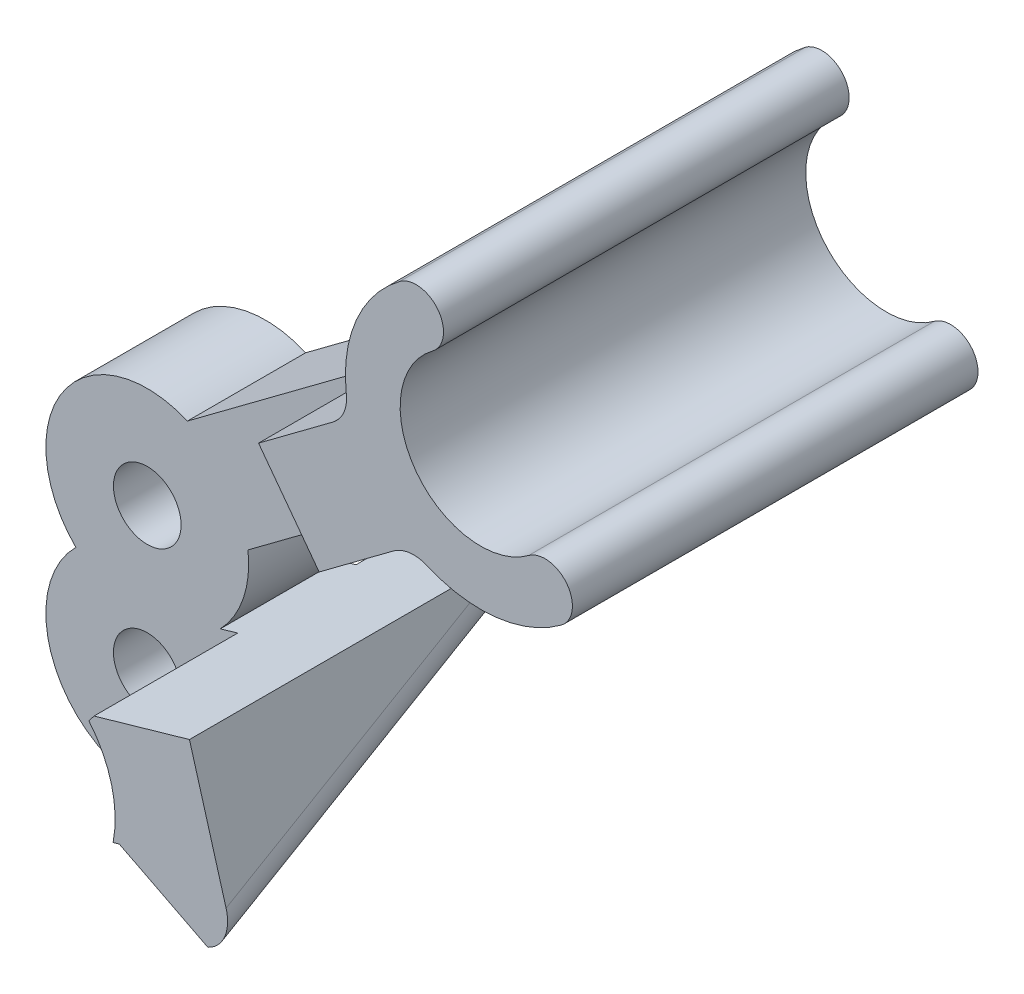
ISO-10303-21;
HEADER;
FILE_DESCRIPTION(('STEP AP214'),'2;1');
FILE_NAME('part.step','',(''),(''),'','','');
FILE_SCHEMA(('AUTOMOTIVE_DESIGN { 1 0 10303 214 1 1 1 1 }'));
ENDSEC;
DATA;
#1=APPLICATION_CONTEXT('core data for automotive mechanical design processes');
#2=APPLICATION_PROTOCOL_DEFINITION('international standard','automotive_design',2000,#1);
#3=PRODUCT_CONTEXT('',#1,'mechanical');
#4=PRODUCT('Part','Part','',(#3));
#5=PRODUCT_RELATED_PRODUCT_CATEGORY('part','',(#4));
#6=PRODUCT_DEFINITION_FORMATION('','',#4);
#7=PRODUCT_DEFINITION_CONTEXT('part definition',#1,'design');
#8=PRODUCT_DEFINITION('design','',#6,#7);
#9=PRODUCT_DEFINITION_SHAPE('','',#8);
#10=(LENGTH_UNIT() NAMED_UNIT(*) SI_UNIT(.MILLI.,.METRE.));
#11=(NAMED_UNIT(*) PLANE_ANGLE_UNIT() SI_UNIT($,.RADIAN.));
#12=(NAMED_UNIT(*) SI_UNIT($,.STERADIAN.) SOLID_ANGLE_UNIT());
#13=UNCERTAINTY_MEASURE_WITH_UNIT(LENGTH_MEASURE(1.E-05),#10,'distance_accuracy_value','');
#14=(GEOMETRIC_REPRESENTATION_CONTEXT(3) GLOBAL_UNCERTAINTY_ASSIGNED_CONTEXT((#13)) GLOBAL_UNIT_ASSIGNED_CONTEXT((#10,
#11,#12)) REPRESENTATION_CONTEXT('',''));
#15=CARTESIAN_POINT('',(0.,0.,0.));
#16=DIRECTION('',(0.,0.,1.));
#17=DIRECTION('',(1.,0.,0.));
#18=AXIS2_PLACEMENT_3D('',#15,#16,#17);
#19=CARTESIAN_POINT('',(12.034625399238,11.3594857649784,12.));
#20=DIRECTION('',(-0.597625146975519,0.801775644243755,0.));
#21=DIRECTION('',(-0.801775644243755,-0.59762514697552,0.));
#22=AXIS2_PLACEMENT_3D('',#19,#20,#21);
#23=PLANE('',#22);
#24=DIRECTION('',(0.801775644243755,0.59762514697552,0.));
#25=VECTOR('',#24,1.);
#26=CARTESIAN_POINT('',(12.034625399238,11.3594857649784,0.));
#27=LINE('',#26,#25);
#28=CARTESIAN_POINT('',(9.33520353574942,9.34739871856042,0.));
#29=VERTEX_POINT('',#28);
#30=CARTESIAN_POINT('',(11.5358986788997,10.9877463242975,0.));
#31=VERTEX_POINT('',#30);
#32=EDGE_CURVE('E301',#29,#31,#27,.T.);
#33=ORIENTED_EDGE('',*,*,#32,.T.);
#34=DIRECTION('',(0.,0.,1.));
#35=VECTOR('',#34,1.);
#36=CARTESIAN_POINT('',(11.5358986788997,10.9877463242975,12.));
#37=LINE('',#36,#35);
#38=CARTESIAN_POINT('',(11.5358986788997,10.9877463242975,12.));
#39=VERTEX_POINT('',#38);
#40=EDGE_CURVE('E249',#31,#39,#37,.T.);
#41=ORIENTED_EDGE('',*,*,#40,.T.);
#42=DIRECTION('',(0.801775644243755,0.59762514697552,0.));
#43=VECTOR('',#42,1.);
#44=CARTESIAN_POINT('',(12.034625399238,11.3594857649784,12.));
#45=LINE('',#44,#43);
#46=CARTESIAN_POINT('',(9.33520353574942,9.34739871856042,12.));
#47=VERTEX_POINT('',#46);
#48=EDGE_CURVE('E389',#47,#39,#45,.T.);
#49=ORIENTED_EDGE('',*,*,#48,.F.);
#50=DIRECTION('',(0.,0.,1.));
#51=VECTOR('',#50,1.);
#52=CARTESIAN_POINT('',(9.33520353574942,9.34739871856042,-3.68469303146442));
#53=LINE('',#52,#51);
#54=CARTESIAN_POINT('',(9.33520353574942,9.34739871856042,7.75));
#55=VERTEX_POINT('',#54);
#56=EDGE_CURVE('E421',#55,#47,#53,.T.);
#57=ORIENTED_EDGE('',*,*,#56,.F.);
#58=DIRECTION('',(0.801775644243755,0.59762514697552,0.));
#59=VECTOR('',#58,1.);
#60=CARTESIAN_POINT('',(12.034625399238,11.3594857649784,7.75));
#61=LINE('',#60,#59);
#62=CARTESIAN_POINT('',(2.97951194861546,4.61001221129799,7.75));
#63=VERTEX_POINT('',#62);
#64=EDGE_CURVE('E380',#63,#55,#61,.T.);
#65=ORIENTED_EDGE('',*,*,#64,.F.);
#66=DIRECTION('',(0.,0.,-1.));
#67=VECTOR('',#66,1.);
#68=CARTESIAN_POINT('',(2.97951194861546,4.61001221129799,12.));
#69=LINE('',#68,#67);
#70=CARTESIAN_POINT('',(2.97951194861546,4.61001221129799,4.25));
#71=VERTEX_POINT('',#70);
#72=EDGE_CURVE('E344',#63,#71,#69,.T.);
#73=ORIENTED_EDGE('',*,*,#72,.T.);
#74=DIRECTION('',(-0.801775644243755,-0.59762514697552,0.));
#75=VECTOR('',#74,1.);
#76=CARTESIAN_POINT('',(12.034625399238,11.3594857649784,4.25));
#77=LINE('',#76,#75);
#78=CARTESIAN_POINT('',(9.33520353574942,9.34739871856042,4.25));
#79=VERTEX_POINT('',#78);
#80=EDGE_CURVE('E556',#79,#71,#77,.T.);
#81=ORIENTED_EDGE('',*,*,#80,.F.);
#82=DIRECTION('',(0.,0.,-1.));
#83=VECTOR('',#82,1.);
#84=CARTESIAN_POINT('',(9.33520353574942,9.34739871856042,19.1846930314644));
#85=LINE('',#84,#83);
#86=EDGE_CURVE('E538',#79,#29,#85,.T.);
#87=ORIENTED_EDGE('',*,*,#86,.T.);
#88=EDGE_LOOP('',(#33,#41,#49,#57,#65,#73,#81,#87));
#89=FACE_BOUND('',#88,.T.);
#90=ADVANCED_FACE('F37',(#89),#23,.F.);
#91=CARTESIAN_POINT('',(1.18663650768889,7.01533914402926,12.));
#92=DIRECTION('',(0.597625146975519,-0.801775644243755,0.));
#93=DIRECTION('',(0.801775644243755,0.59762514697552,0.));
#94=AXIS2_PLACEMENT_3D('',#91,#92,#93);
#95=PLANE('',#94);
#96=DIRECTION('',(-0.801775644243755,-0.597625146975519,0.));
#97=VECTOR('',#96,1.);
#98=CARTESIAN_POINT('',(1.18663650768889,7.01533914402926,12.));
#99=LINE('',#98,#97);
#100=CARTESIAN_POINT('',(9.74302323797318,13.3930732570287,12.));
#101=VERTEX_POINT('',#100);
#102=CARTESIAN_POINT('',(7.54232809482285,11.7527256512917,12.));
#103=VERTEX_POINT('',#102);
#104=EDGE_CURVE('E403',#101,#103,#99,.T.);
#105=ORIENTED_EDGE('',*,*,#104,.F.);
#106=DIRECTION('',(0.,0.,1.));
#107=VECTOR('',#106,1.);
#108=CARTESIAN_POINT('',(9.74302323797318,13.3930732570287,0.));
#109=LINE('',#108,#107);
#110=CARTESIAN_POINT('',(9.74302323797318,13.3930732570287,0.));
#111=VERTEX_POINT('',#110);
#112=EDGE_CURVE('E257',#101,#111,#109,.F.);
#113=ORIENTED_EDGE('',*,*,#112,.T.);
#114=DIRECTION('',(-0.801775644243755,-0.597625146975519,0.));
#115=VECTOR('',#114,1.);
#116=CARTESIAN_POINT('',(1.18663650768889,7.01533914402926,0.));
#117=LINE('',#116,#115);
#118=CARTESIAN_POINT('',(7.54232809482285,11.7527256512917,0.));
#119=VERTEX_POINT('',#118);
#120=EDGE_CURVE('E322',#111,#119,#117,.T.);
#121=ORIENTED_EDGE('',*,*,#120,.T.);
#122=DIRECTION('',(0.,0.,-1.));
#123=VECTOR('',#122,1.);
#124=CARTESIAN_POINT('',(7.54232809482285,11.7527256512917,19.1846930314644));
#125=LINE('',#124,#123);
#126=CARTESIAN_POINT('',(7.54232809482285,11.7527256512917,4.25));
#127=VERTEX_POINT('',#126);
#128=EDGE_CURVE('E536',#127,#119,#125,.T.);
#129=ORIENTED_EDGE('',*,*,#128,.F.);
#130=DIRECTION('',(0.801775644243755,0.59762514697552,0.));
#131=VECTOR('',#130,1.);
#132=CARTESIAN_POINT('',(1.18663650768889,7.01533914402926,4.25));
#133=LINE('',#132,#131);
#134=CARTESIAN_POINT('',(1.18663650768889,7.01533914402926,4.25));
#135=VERTEX_POINT('',#134);
#136=EDGE_CURVE('E554',#135,#127,#133,.T.);
#137=ORIENTED_EDGE('',*,*,#136,.F.);
#138=DIRECTION('',(0.,0.,-1.));
#139=VECTOR('',#138,1.);
#140=CARTESIAN_POINT('',(1.18663650768889,7.01533914402926,12.));
#141=LINE('',#140,#139);
#142=CARTESIAN_POINT('',(1.18663650768889,7.01533914402926,7.75));
#143=VERTEX_POINT('',#142);
#144=EDGE_CURVE('E329',#143,#135,#141,.T.);
#145=ORIENTED_EDGE('',*,*,#144,.F.);
#146=DIRECTION('',(-0.801775644243755,-0.59762514697552,0.));
#147=VECTOR('',#146,1.);
#148=CARTESIAN_POINT('',(1.18663650768889,7.01533914402926,7.75));
#149=LINE('',#148,#147);
#150=CARTESIAN_POINT('',(7.54232809482285,11.7527256512917,7.75));
#151=VERTEX_POINT('',#150);
#152=EDGE_CURVE('E378',#151,#143,#149,.T.);
#153=ORIENTED_EDGE('',*,*,#152,.F.);
#154=DIRECTION('',(0.,0.,1.));
#155=VECTOR('',#154,1.);
#156=CARTESIAN_POINT('',(7.54232809482285,11.7527256512917,-3.68469303146442));
#157=LINE('',#156,#155);
#158=EDGE_CURVE('E419',#151,#103,#157,.T.);
#159=ORIENTED_EDGE('',*,*,#158,.T.);
#160=EDGE_LOOP('',(#105,#113,#121,#129,#137,#145,#153,#159));
#161=FACE_BOUND('',#160,.T.);
#162=ADVANCED_FACE('F424',(#161),#95,.F.);
#163=CARTESIAN_POINT('',(0.,0.,0.));
#164=DIRECTION('',(0.,0.,1.));
#165=DIRECTION('',(1.,0.,0.));
#166=AXIS2_PLACEMENT_3D('',#163,#164,#165);
#167=PLANE('',#166);
#168=DIRECTION('',(-0.597625146975519,0.801775644243755,0.));
#169=VECTOR('',#168,1.);
#170=CARTESIAN_POINT('',(7.54232809482285,11.7527256512917,0.));
#171=LINE('',#170,#169);
#172=EDGE_CURVE('E532',#29,#119,#171,.T.);
#173=ORIENTED_EDGE('',*,*,#172,.T.);
#174=ORIENTED_EDGE('',*,*,#120,.F.);
#175=CARTESIAN_POINT('',(9.14539809099766,14.1948489012725,0.));
#176=DIRECTION('',(0.,0.,1.));
#177=DIRECTION('',(1.,0.,0.));
#178=AXIS2_PLACEMENT_3D('',#175,#176,#177);
#179=CIRCLE('',#178,1.);
#180=CARTESIAN_POINT('',(10.1385687405361,14.3115196383718,0.));
#181=VERTEX_POINT('',#180);
#182=EDGE_CURVE('E266',#111,#181,#179,.T.);
#183=ORIENTED_EDGE('',*,*,#182,.T.);
#184=CARTESIAN_POINT('',(14.1112513386901,14.7782025867691,0.));
#185=DIRECTION('',(0.,0.,1.));
#186=DIRECTION('',(-1.,0.,0.));
#187=AXIS2_PLACEMENT_3D('',#184,#185,#186);
#188=CIRCLE('',#187,4.);
#189=CARTESIAN_POINT('',(11.720750750788,17.9853051637442,0.));
#190=VERTEX_POINT('',#189);
#191=EDGE_CURVE('E319',#190,#181,#188,.T.);
#192=ORIENTED_EDGE('',*,*,#191,.F.);
#193=CARTESIAN_POINT('',(12.2048271198382,17.3358668919067,0.));
#194=DIRECTION('',(0.,0.,1.));
#195=DIRECTION('',(-1.,0.,0.));
#196=AXIS2_PLACEMENT_3D('',#193,#194,#195);
#197=CIRCLE('',#196,0.810000000000002);
#198=CARTESIAN_POINT('',(12.6889034888884,16.6864286200693,0.));
#199=VERTEX_POINT('',#198);
#200=EDGE_CURVE('E317',#199,#190,#197,.T.);
#201=ORIENTED_EDGE('',*,*,#200,.F.);
#202=CARTESIAN_POINT('',(14.1112513386901,14.7782025867691,0.));
#203=DIRECTION('',(0.,0.,-1.));
#204=DIRECTION('',(1.,0.,0.));
#205=AXIS2_PLACEMENT_3D('',#202,#203,#204);
#206=CIRCLE('',#205,2.38);
#207=CARTESIAN_POINT('',(15.5335991884918,12.869976553469,0.));
#208=VERTEX_POINT('',#207);
#209=EDGE_CURVE('E315',#208,#199,#206,.T.);
#210=ORIENTED_EDGE('',*,*,#209,.F.);
#211=CARTESIAN_POINT('',(16.017675557542,12.2205382816316,0.));
#212=DIRECTION('',(0.,0.,1.));
#213=DIRECTION('',(-1.,0.,0.));
#214=AXIS2_PLACEMENT_3D('',#211,#212,#213);
#215=CIRCLE('',#214,0.810000000000002);
#216=CARTESIAN_POINT('',(16.5017519265922,11.5711000097941,0.));
#217=VERTEX_POINT('',#216);
#218=EDGE_CURVE('E313',#217,#208,#215,.T.);
#219=ORIENTED_EDGE('',*,*,#218,.F.);
#220=CARTESIAN_POINT('',(14.1112513386901,14.7782025867691,0.));
#221=DIRECTION('',(0.,0.,1.));
#222=DIRECTION('',(-1.,0.,0.));
#223=AXIS2_PLACEMENT_3D('',#220,#221,#222);
#224=CIRCLE('',#223,4.);
#225=CARTESIAN_POINT('',(12.5290693284382,11.1044170613968,0.));
#226=VERTEX_POINT('',#225);
#227=EDGE_CURVE('E305',#226,#217,#224,.T.);
#228=ORIENTED_EDGE('',*,*,#227,.F.);
#229=CARTESIAN_POINT('',(12.1335238258753,10.1859706800537,0.));
#230=DIRECTION('',(0.,0.,1.));
#231=DIRECTION('',(1.,0.,0.));
#232=AXIS2_PLACEMENT_3D('',#229,#230,#231);
#233=CIRCLE('',#232,1.);
#234=EDGE_CURVE('E262',#226,#31,#233,.T.);
#235=ORIENTED_EDGE('',*,*,#234,.T.);
#236=ORIENTED_EDGE('',*,*,#32,.F.);
#237=EDGE_LOOP('',(#173,#174,#183,#192,#201,#210,#219,#228,#235,#236));
#238=FACE_BOUND('',#237,.T.);
#239=ADVANCED_FACE('F457',(#238),#167,.F.);
#240=CARTESIAN_POINT('',(0.,4.26,12.));
#241=DIRECTION('',(0.,0.,-1.));
#242=DIRECTION('',(-1.,0.,0.));
#243=AXIS2_PLACEMENT_3D('',#240,#241,#242);
#244=CYLINDRICAL_SURFACE('',#243,3.);
#245=CARTESIAN_POINT('',(0.,4.26,4.25));
#246=DIRECTION('',(0.,0.,-1.));
#247=DIRECTION('',(-1.,0.,0.));
#248=AXIS2_PLACEMENT_3D('',#245,#246,#247);
#249=CIRCLE('',#248,3.);
#250=CARTESIAN_POINT('',(2.16231592536831,2.18048326794454,4.25));
#251=VERTEX_POINT('',#250);
#252=EDGE_CURVE('E558',#71,#251,#249,.T.);
#253=ORIENTED_EDGE('',*,*,#252,.F.);
#254=ORIENTED_EDGE('',*,*,#72,.F.);
#255=CARTESIAN_POINT('',(0.,4.26,7.75));
#256=DIRECTION('',(0.,0.,1.));
#257=DIRECTION('',(1.,0.,0.));
#258=AXIS2_PLACEMENT_3D('',#255,#256,#257);
#259=CIRCLE('',#258,3.);
#260=CARTESIAN_POINT('',(2.16231592536831,2.18048326794454,7.75));
#261=VERTEX_POINT('',#260);
#262=EDGE_CURVE('E382',#261,#63,#259,.T.);
#263=ORIENTED_EDGE('',*,*,#262,.F.);
#264=DIRECTION('',(0.,0.,-1.));
#265=VECTOR('',#264,1.);
#266=CARTESIAN_POINT('',(2.16231592536831,2.18048326794454,12.));
#267=LINE('',#266,#265);
#268=EDGE_CURVE('E347',#261,#251,#267,.T.);
#269=ORIENTED_EDGE('',*,*,#268,.T.);
#270=EDGE_LOOP('',(#253,#254,#263,#269));
#271=FACE_BOUND('',#270,.T.);
#272=ADVANCED_FACE('F461',(#271),#244,.T.);
#273=CARTESIAN_POINT('',(0.,4.26,12.));
#274=DIRECTION('',(0.,0.,-1.));
#275=DIRECTION('',(-1.,0.,0.));
#276=AXIS2_PLACEMENT_3D('',#273,#274,#275);
#277=CYLINDRICAL_SURFACE('',#276,3.);
#278=CARTESIAN_POINT('',(0.,4.26,4.25));
#279=DIRECTION('',(0.,0.,-1.));
#280=DIRECTION('',(-1.,0.,0.));
#281=AXIS2_PLACEMENT_3D('',#278,#279,#280);
#282=CIRCLE('',#281,3.);
#283=CARTESIAN_POINT('',(-2.11260502697499,2.13,4.25));
#284=VERTEX_POINT('',#283);
#285=EDGE_CURVE('E228',#284,#135,#282,.T.);
#286=ORIENTED_EDGE('',*,*,#285,.F.);
#287=DIRECTION('',(0.,0.,-1.));
#288=VECTOR('',#287,1.);
#289=CARTESIAN_POINT('',(-2.11260502697499,2.13,12.));
#290=LINE('',#289,#288);
#291=CARTESIAN_POINT('',(-2.11260502697499,2.13,7.75));
#292=VERTEX_POINT('',#291);
#293=EDGE_CURVE('E224',#292,#284,#290,.T.);
#294=ORIENTED_EDGE('',*,*,#293,.F.);
#295=CARTESIAN_POINT('',(0.,4.26,7.75));
#296=DIRECTION('',(0.,0.,1.));
#297=DIRECTION('',(1.,0.,0.));
#298=AXIS2_PLACEMENT_3D('',#295,#296,#297);
#299=CIRCLE('',#298,3.);
#300=EDGE_CURVE('E376',#143,#292,#299,.T.);
#301=ORIENTED_EDGE('',*,*,#300,.F.);
#302=ORIENTED_EDGE('',*,*,#144,.T.);
#303=EDGE_LOOP('',(#286,#294,#301,#302));
#304=FACE_BOUND('',#303,.T.);
#305=ADVANCED_FACE('F463',(#304),#277,.T.);
#306=CARTESIAN_POINT('',(0.,0.,12.));
#307=DIRECTION('',(0.,0.,-1.));
#308=DIRECTION('',(-1.,0.,0.));
#309=AXIS2_PLACEMENT_3D('',#306,#307,#308);
#310=CYLINDRICAL_SURFACE('',#309,3.);
#311=DIRECTION('',(0.,0.,-1.));
#312=VECTOR('',#311,1.);
#313=CARTESIAN_POINT('',(2.91088717882799,-0.725765686799011,12.));
#314=LINE('',#313,#312);
#315=CARTESIAN_POINT('',(2.91088717882799,-0.725765686799011,7.75));
#316=VERTEX_POINT('',#315);
#317=CARTESIAN_POINT('',(2.91088717882799,-0.725765686799011,7.17942970265402));
#318=VERTEX_POINT('',#317);
#319=EDGE_CURVE('E326',#316,#318,#314,.T.);
#320=ORIENTED_EDGE('',*,*,#319,.F.);
#321=CARTESIAN_POINT('',(0.,0.,7.75));
#322=DIRECTION('',(0.,0.,1.));
#323=DIRECTION('',(1.,0.,0.));
#324=AXIS2_PLACEMENT_3D('',#321,#322,#323);
#325=CIRCLE('',#324,3.);
#326=EDGE_CURVE('E374',#292,#316,#325,.T.);
#327=ORIENTED_EDGE('',*,*,#326,.F.);
#328=ORIENTED_EDGE('',*,*,#293,.T.);
#329=CARTESIAN_POINT('',(0.,0.,4.25));
#330=DIRECTION('',(0.,0.,-1.));
#331=DIRECTION('',(-1.,0.,0.));
#332=AXIS2_PLACEMENT_3D('',#329,#330,#331);
#333=CIRCLE('',#332,3.);
#334=CARTESIAN_POINT('',(2.94761352344999,0.558188602870693,4.25));
#335=VERTEX_POINT('',#334);
#336=EDGE_CURVE('E216',#335,#284,#333,.T.);
#337=ORIENTED_EDGE('',*,*,#336,.F.);
#338=CARTESIAN_POINT('',(0.,0.,3.58971485132701));
#339=DIRECTION('',(-0.2543265565073,0.88694210661589,0.385553760410797));
#340=DIRECTION('',(-0.106273019044932,0.37061806160788,-0.92268537315441));
#341=AXIS2_PLACEMENT_3D('',#338,#339,#340);
#342=ELLIPSE('',#341,7.78101605546158,3.);
#343=EDGE_CURVE('E220',#335,#318,#342,.F.);
#344=ORIENTED_EDGE('',*,*,#343,.T.);
#345=EDGE_LOOP('',(#320,#327,#328,#337,#344));
#346=FACE_BOUND('',#345,.T.);
#347=ADVANCED_FACE('F219',(#346),#310,.T.);
#348=CARTESIAN_POINT('',(0.,0.,12.));
#349=DIRECTION('',(0.,0.,-1.));
#350=DIRECTION('',(-1.,0.,0.));
#351=AXIS2_PLACEMENT_3D('',#348,#349,#350);
#352=CYLINDRICAL_SURFACE('',#351,1.00000000000001);
#353=CARTESIAN_POINT('',(0.,0.,7.75));
#354=DIRECTION('',(0.,0.,1.));
#355=DIRECTION('',(1.,0.,0.));
#356=AXIS2_PLACEMENT_3D('',#353,#354,#355);
#357=CIRCLE('',#356,1.00000000000001);
#358=CARTESIAN_POINT('',(1.00000000000001,0.,7.75));
#359=VERTEX_POINT('',#358);
#360=EDGE_CURVE('E352',#359,#359,#357,.T.);
#361=ORIENTED_EDGE('',*,*,#360,.T.);
#362=EDGE_LOOP('',(#361));
#363=FACE_BOUND('',#362,.T.);
#364=CARTESIAN_POINT('',(0.,0.,4.25));
#365=DIRECTION('',(0.,0.,-1.));
#366=DIRECTION('',(-1.,0.,0.));
#367=AXIS2_PLACEMENT_3D('',#364,#365,#366);
#368=CIRCLE('',#367,1.00000000000001);
#369=CARTESIAN_POINT('',(-1.00000000000001,0.,4.25));
#370=VERTEX_POINT('',#369);
#371=EDGE_CURVE('E565',#370,#370,#368,.T.);
#372=ORIENTED_EDGE('',*,*,#371,.T.);
#373=EDGE_LOOP('',(#372));
#374=FACE_BOUND('',#373,.T.);
#375=ADVANCED_FACE('F474',(#363,#374),#352,.F.);
#376=CARTESIAN_POINT('',(0.,4.26,12.));
#377=DIRECTION('',(0.,0.,-1.));
#378=DIRECTION('',(-1.,0.,0.));
#379=AXIS2_PLACEMENT_3D('',#376,#377,#378);
#380=CYLINDRICAL_SURFACE('',#379,1.00000000000001);
#381=CARTESIAN_POINT('',(0.,4.26,7.75));
#382=DIRECTION('',(0.,0.,1.));
#383=DIRECTION('',(1.,0.,0.));
#384=AXIS2_PLACEMENT_3D('',#381,#382,#383);
#385=CIRCLE('',#384,1.00000000000001);
#386=CARTESIAN_POINT('',(1.00000000000001,4.26,7.75));
#387=VERTEX_POINT('',#386);
#388=EDGE_CURVE('E350',#387,#387,#385,.T.);
#389=ORIENTED_EDGE('',*,*,#388,.T.);
#390=EDGE_LOOP('',(#389));
#391=FACE_BOUND('',#390,.T.);
#392=CARTESIAN_POINT('',(0.,4.26,4.25));
#393=DIRECTION('',(0.,0.,-1.));
#394=DIRECTION('',(-1.,0.,0.));
#395=AXIS2_PLACEMENT_3D('',#392,#393,#394);
#396=CIRCLE('',#395,1.00000000000001);
#397=CARTESIAN_POINT('',(-1.,4.26,4.25));
#398=VERTEX_POINT('',#397);
#399=EDGE_CURVE('E562',#398,#398,#396,.T.);
#400=ORIENTED_EDGE('',*,*,#399,.T.);
#401=EDGE_LOOP('',(#400));
#402=FACE_BOUND('',#401,.T.);
#403=ADVANCED_FACE('F467',(#391,#402),#380,.F.);
#404=CARTESIAN_POINT('',(2.16231592536831,2.18048326794454,12.));
#405=DIRECTION('',(0.275637355816997,-0.96126169593832,0.));
#406=DIRECTION('',(0.96126169593832,0.275637355816997,0.));
#407=AXIS2_PLACEMENT_3D('',#404,#405,#406);
#408=PLANE('',#407);
#409=DIRECTION('',(0.,0.,-1.));
#410=VECTOR('',#409,1.);
#411=CARTESIAN_POINT('',(5.49830339629517,3.13706228218201,12.));
#412=LINE('',#411,#410);
#413=CARTESIAN_POINT('',(5.49830339629517,3.13706228218201,12.));
#414=VERTEX_POINT('',#413);
#415=CARTESIAN_POINT('',(5.49830339629517,3.13706228218201,2.59367201848719));
#416=VERTEX_POINT('',#415);
#417=EDGE_CURVE('E252',#414,#416,#412,.T.);
#418=ORIENTED_EDGE('',*,*,#417,.T.);
#419=CARTESIAN_POINT('',(4.53704170035685,2.86142492636501,2.59367201848719));
#420=DIRECTION('',(0.275637355816997,-0.96126169593832,0.));
#421=DIRECTION('',(0.,0.,1.));
#422=AXIS2_PLACEMENT_3D('',#419,#420,#421);
#423=ELLIPSE('',#422,2.59367201848719,1.);
#424=CARTESIAN_POINT('',(4.53704170035685,2.86142492636501,0.));
#425=VERTEX_POINT('',#424);
#426=EDGE_CURVE('E11',#416,#425,#423,.F.);
#427=ORIENTED_EDGE('',*,*,#426,.T.);
#428=DIRECTION('',(-0.961261695938319,-0.275637355816997,0.));
#429=VECTOR('',#428,1.);
#430=CARTESIAN_POINT('',(2.16231592536831,2.18048326794454,0.));
#431=LINE('',#430,#429);
#432=CARTESIAN_POINT('',(2.67495094612393,2.32747899472459,0.));
#433=VERTEX_POINT('',#432);
#434=EDGE_CURVE('E295',#425,#433,#431,.T.);
#435=ORIENTED_EDGE('',*,*,#434,.T.);
#436=DIRECTION('',(0.,0.,-1.));
#437=VECTOR('',#436,1.);
#438=CARTESIAN_POINT('',(2.67495094612392,2.32747899472459,4.25));
#439=LINE('',#438,#437);
#440=CARTESIAN_POINT('',(2.67495094612392,2.32747899472459,4.25));
#441=VERTEX_POINT('',#440);
#442=EDGE_CURVE('E422',#441,#433,#439,.T.);
#443=ORIENTED_EDGE('',*,*,#442,.F.);
#444=DIRECTION('',(0.96126169593832,0.275637355816997,0.));
#445=VECTOR('',#444,1.);
#446=CARTESIAN_POINT('',(2.16231592536831,2.18048326794454,4.25));
#447=LINE('',#446,#445);
#448=EDGE_CURVE('E560',#251,#441,#447,.T.);
#449=ORIENTED_EDGE('',*,*,#448,.F.);
#450=ORIENTED_EDGE('',*,*,#268,.F.);
#451=DIRECTION('',(-0.96126169593832,-0.275637355816997,0.));
#452=VECTOR('',#451,1.);
#453=CARTESIAN_POINT('',(2.16231592536831,2.18048326794454,7.75));
#454=LINE('',#453,#452);
#455=CARTESIAN_POINT('',(2.67495094612392,2.32747899472459,7.75));
#456=VERTEX_POINT('',#455);
#457=EDGE_CURVE('E308',#456,#261,#454,.T.);
#458=ORIENTED_EDGE('',*,*,#457,.F.);
#459=DIRECTION('',(0.,0.,1.));
#460=VECTOR('',#459,1.);
#461=CARTESIAN_POINT('',(2.67495094612392,2.32747899472459,7.75));
#462=LINE('',#461,#460);
#463=CARTESIAN_POINT('',(2.67495094612392,2.32747899472459,12.));
#464=VERTEX_POINT('',#463);
#465=EDGE_CURVE('E302',#456,#464,#462,.T.);
#466=ORIENTED_EDGE('',*,*,#465,.T.);
#467=DIRECTION('',(-0.961261695938319,-0.275637355816997,0.));
#468=VECTOR('',#467,1.);
#469=CARTESIAN_POINT('',(2.16231592536831,2.18048326794454,12.));
#470=LINE('',#469,#468);
#471=EDGE_CURVE('E386',#414,#464,#470,.T.);
#472=ORIENTED_EDGE('',*,*,#471,.F.);
#473=EDGE_LOOP('',(#418,#427,#435,#443,#449,#450,#458,#466,#472));
#474=FACE_BOUND('',#473,.T.);
#475=ADVANCED_FACE('F293',(#474),#408,.F.);
#476=CARTESIAN_POINT('',(2.91088717882799,-0.72576568679901,12.));
#477=DIRECTION('',(-0.275637355816996,0.96126169593832,0.));
#478=DIRECTION('',(-0.96126169593832,-0.275637355816996,0.));
#479=AXIS2_PLACEMENT_3D('',#476,#477,#478);
#480=PLANE('',#479);
#481=ORIENTED_EDGE('',*,*,#319,.T.);
#482=DIRECTION('',(0.96126169593832,0.275637355816996,0.));
#483=VECTOR('',#482,1.);
#484=CARTESIAN_POINT('',(2.910887178828,-0.725765686799008,7.17942970265402));
#485=LINE('',#484,#483);
#486=CARTESIAN_POINT('',(3.42192823783759,-0.579227021194715,7.17942970265402));
#487=VERTEX_POINT('',#486);
#488=EDGE_CURVE('E237',#318,#487,#485,.T.);
#489=ORIENTED_EDGE('',*,*,#488,.T.);
#490=DIRECTION('',(0.,0.,-1.));
#491=VECTOR('',#490,1.);
#492=CARTESIAN_POINT('',(3.42192823783759,-0.579227021194715,12.));
#493=LINE('',#492,#491);
#494=CARTESIAN_POINT('',(3.42192823783759,-0.579227021194715,12.));
#495=VERTEX_POINT('',#494);
#496=EDGE_CURVE('E289',#495,#487,#493,.T.);
#497=ORIENTED_EDGE('',*,*,#496,.F.);
#498=DIRECTION('',(0.96126169593832,0.275637355816996,0.));
#499=VECTOR('',#498,1.);
#500=CARTESIAN_POINT('',(2.91088717882799,-0.72576568679901,12.));
#501=LINE('',#500,#499);
#502=CARTESIAN_POINT('',(3.23897683092303,-0.631687492945547,12.));
#503=VERTEX_POINT('',#502);
#504=EDGE_CURVE('E287',#503,#495,#501,.T.);
#505=ORIENTED_EDGE('',*,*,#504,.F.);
#506=DIRECTION('',(0.,0.,1.));
#507=VECTOR('',#506,1.);
#508=CARTESIAN_POINT('',(3.23897683092303,-0.631687492945547,7.75));
#509=LINE('',#508,#507);
#510=CARTESIAN_POINT('',(3.23897683092303,-0.631687492945547,7.75));
#511=VERTEX_POINT('',#510);
#512=EDGE_CURVE('E246',#503,#511,#509,.F.);
#513=ORIENTED_EDGE('',*,*,#512,.T.);
#514=DIRECTION('',(0.96126169593832,0.275637355816996,0.));
#515=VECTOR('',#514,1.);
#516=CARTESIAN_POINT('',(2.91088717882799,-0.72576568679901,7.75));
#517=LINE('',#516,#515);
#518=EDGE_CURVE('E357',#316,#511,#517,.T.);
#519=ORIENTED_EDGE('',*,*,#518,.F.);
#520=EDGE_LOOP('',(#481,#489,#497,#505,#513,#519));
#521=FACE_BOUND('',#520,.T.);
#522=ADVANCED_FACE('F466',(#521),#480,.F.);
#523=CARTESIAN_POINT('',(0.,0.,12.));
#524=DIRECTION('',(0.,0.,1.));
#525=DIRECTION('',(1.,0.,0.));
#526=AXIS2_PLACEMENT_3D('',#523,#524,#525);
#527=PLANE('',#526);
#528=DIRECTION('',(-0.597625146975519,0.801775644243755,0.));
#529=VECTOR('',#528,1.);
#530=CARTESIAN_POINT('',(7.54232809482285,11.7527256512917,12.));
#531=LINE('',#530,#529);
#532=EDGE_CURVE('E409',#47,#103,#531,.T.);
#533=ORIENTED_EDGE('',*,*,#532,.F.);
#534=ORIENTED_EDGE('',*,*,#48,.T.);
#535=CARTESIAN_POINT('',(12.1335238258753,10.1859706800537,12.));
#536=DIRECTION('',(0.,0.,1.));
#537=DIRECTION('',(1.,0.,0.));
#538=AXIS2_PLACEMENT_3D('',#535,#536,#537);
#539=CIRCLE('',#538,1.);
#540=CARTESIAN_POINT('',(12.5290693284382,11.1044170613968,12.));
#541=VERTEX_POINT('',#540);
#542=EDGE_CURVE('E264',#39,#541,#539,.F.);
#543=ORIENTED_EDGE('',*,*,#542,.T.);
#544=CARTESIAN_POINT('',(14.1112513386901,14.7782025867691,12.));
#545=DIRECTION('',(0.,0.,1.));
#546=DIRECTION('',(-1.,0.,0.));
#547=AXIS2_PLACEMENT_3D('',#544,#545,#546);
#548=CIRCLE('',#547,4.);
#549=CARTESIAN_POINT('',(16.5017519265922,11.5711000097941,12.));
#550=VERTEX_POINT('',#549);
#551=EDGE_CURVE('E392',#541,#550,#548,.T.);
#552=ORIENTED_EDGE('',*,*,#551,.T.);
#553=CARTESIAN_POINT('',(16.017675557542,12.2205382816316,12.));
#554=DIRECTION('',(0.,0.,1.));
#555=DIRECTION('',(-1.,0.,0.));
#556=AXIS2_PLACEMENT_3D('',#553,#554,#555);
#557=CIRCLE('',#556,0.810000000000002);
#558=CARTESIAN_POINT('',(15.5335991884918,12.869976553469,12.));
#559=VERTEX_POINT('',#558);
#560=EDGE_CURVE('E394',#550,#559,#557,.T.);
#561=ORIENTED_EDGE('',*,*,#560,.T.);
#562=CARTESIAN_POINT('',(14.1112513386901,14.7782025867691,12.));
#563=DIRECTION('',(0.,0.,-1.));
#564=DIRECTION('',(1.,0.,0.));
#565=AXIS2_PLACEMENT_3D('',#562,#563,#564);
#566=CIRCLE('',#565,2.38);
#567=CARTESIAN_POINT('',(12.6889034888884,16.6864286200693,12.));
#568=VERTEX_POINT('',#567);
#569=EDGE_CURVE('E396',#559,#568,#566,.T.);
#570=ORIENTED_EDGE('',*,*,#569,.T.);
#571=CARTESIAN_POINT('',(12.2048271198382,17.3358668919067,12.));
#572=DIRECTION('',(0.,0.,1.));
#573=DIRECTION('',(-1.,0.,0.));
#574=AXIS2_PLACEMENT_3D('',#571,#572,#573);
#575=CIRCLE('',#574,0.810000000000002);
#576=CARTESIAN_POINT('',(11.720750750788,17.9853051637442,12.));
#577=VERTEX_POINT('',#576);
#578=EDGE_CURVE('E398',#568,#577,#575,.T.);
#579=ORIENTED_EDGE('',*,*,#578,.T.);
#580=CARTESIAN_POINT('',(14.1112513386901,14.7782025867691,12.));
#581=DIRECTION('',(0.,0.,1.));
#582=DIRECTION('',(-1.,0.,0.));
#583=AXIS2_PLACEMENT_3D('',#580,#581,#582);
#584=CIRCLE('',#583,4.);
#585=CARTESIAN_POINT('',(10.1385687405361,14.3115196383718,12.));
#586=VERTEX_POINT('',#585);
#587=EDGE_CURVE('E400',#577,#586,#584,.T.);
#588=ORIENTED_EDGE('',*,*,#587,.T.);
#589=CARTESIAN_POINT('',(9.14539809099766,14.1948489012725,12.));
#590=DIRECTION('',(0.,0.,1.));
#591=DIRECTION('',(1.,0.,0.));
#592=AXIS2_PLACEMENT_3D('',#589,#590,#591);
#593=CIRCLE('',#592,1.);
#594=EDGE_CURVE('E268',#586,#101,#593,.F.);
#595=ORIENTED_EDGE('',*,*,#594,.T.);
#596=ORIENTED_EDGE('',*,*,#104,.T.);
#597=EDGE_LOOP('',(#533,#534,#543,#552,#561,#570,#579,#588,#595,#596));
#598=FACE_BOUND('',#597,.T.);
#599=ADVANCED_FACE('F408',(#598),#527,.T.);
#600=DIRECTION('',(0.89094279765342,-0.454115548411963,0.));
#601=VECTOR('',#600,1.);
#602=CARTESIAN_POINT('',(3.42192823783759,-0.579227021194715,12.));
#603=LINE('',#602,#601);
#604=CARTESIAN_POINT('',(6.04108133102757,-1.91421524537871,12.));
#605=VERTEX_POINT('',#604);
#606=EDGE_CURVE('E280',#495,#605,#603,.T.);
#607=ORIENTED_EDGE('',*,*,#606,.T.);
#608=CARTESIAN_POINT('',(5.6204433687985,-0.91684570063975,12.));
#609=DIRECTION('',(0.,0.,1.));
#610=DIRECTION('',(0.275637355816996,-0.96126169593832,0.));
#611=AXIS2_PLACEMENT_3D('',#608,#609,#610);
#612=ELLIPSE('',#611,1.08379305567755,1.);
#613=CARTESIAN_POINT('',(6.58170506473681,-0.641208344822754,12.));
#614=VERTEX_POINT('',#613);
#615=EDGE_CURVE('E59',#605,#614,#612,.T.);
#616=ORIENTED_EDGE('',*,*,#615,.T.);
#617=DIRECTION('',(-0.275637355816997,0.961261695938319,0.));
#618=VECTOR('',#617,1.);
#619=CARTESIAN_POINT('',(6.32521546374616,0.253277194367051,12.));
#620=LINE('',#619,#618);
#621=EDGE_CURVE('E324',#614,#414,#620,.T.);
#622=ORIENTED_EDGE('',*,*,#621,.T.);
#623=ORIENTED_EDGE('',*,*,#471,.T.);
#624=CARTESIAN_POINT('',(0.,4.26,12.));
#625=DIRECTION('',(0.,0.,1.));
#626=DIRECTION('',(1.,0.,0.));
#627=AXIS2_PLACEMENT_3D('',#624,#625,#626);
#628=CIRCLE('',#627,3.3);
#629=CARTESIAN_POINT('',(2.52053565735539,2.13,12.));
#630=VERTEX_POINT('',#629);
#631=EDGE_CURVE('E370',#630,#464,#628,.T.);
#632=ORIENTED_EDGE('',*,*,#631,.F.);
#633=CARTESIAN_POINT('',(0.,0.,12.));
#634=DIRECTION('',(0.,0.,1.));
#635=DIRECTION('',(1.,0.,0.));
#636=AXIS2_PLACEMENT_3D('',#633,#634,#635);
#637=CIRCLE('',#636,3.3);
#638=EDGE_CURVE('E429',#503,#630,#637,.T.);
#639=ORIENTED_EDGE('',*,*,#638,.F.);
#640=ORIENTED_EDGE('',*,*,#504,.T.);
#641=EDGE_LOOP('',(#607,#616,#622,#623,#632,#639,#640));
#642=FACE_BOUND('',#641,.T.);
#643=ADVANCED_FACE('F284',(#642),#527,.T.);
#644=CARTESIAN_POINT('',(6.32521546374616,0.253277194367051,12.));
#645=DIRECTION('',(-0.961261695938319,-0.275637355816996,0.));
#646=DIRECTION('',(0.275637355816996,-0.96126169593832,0.));
#647=AXIS2_PLACEMENT_3D('',#644,#645,#646);
#648=PLANE('',#647);
#649=ORIENTED_EDGE('',*,*,#621,.F.);
#650=DIRECTION('',(0.106273019044932,-0.37061806160788,0.92268537315441));
#651=VECTOR('',#650,1.);
#652=CARTESIAN_POINT('',(6.54357744896144,-0.508241546858507,11.6689677802951));
#653=LINE('',#652,#651);
#654=EDGE_CURVE('E45',#614,#416,#653,.F.);
#655=ORIENTED_EDGE('',*,*,#654,.T.);
#656=ORIENTED_EDGE('',*,*,#417,.F.);
#657=EDGE_LOOP('',(#649,#655,#656));
#658=FACE_BOUND('',#657,.T.);
#659=ADVANCED_FACE('F437',(#658),#648,.F.);
#660=CARTESIAN_POINT('',(14.1112513386901,14.7782025867691,12.));
#661=DIRECTION('',(0.,0.,-1.));
#662=DIRECTION('',(-1.,0.,0.));
#663=AXIS2_PLACEMENT_3D('',#660,#661,#662);
#664=CYLINDRICAL_SURFACE('',#663,4.);
#665=ORIENTED_EDGE('',*,*,#551,.F.);
#666=DIRECTION('',(0.,0.,-1.));
#667=VECTOR('',#666,1.);
#668=CARTESIAN_POINT('',(12.5290693284382,11.1044170613968,12.));
#669=LINE('',#668,#667);
#670=EDGE_CURVE('E245',#541,#226,#669,.T.);
#671=ORIENTED_EDGE('',*,*,#670,.T.);
#672=ORIENTED_EDGE('',*,*,#227,.T.);
#673=DIRECTION('',(0.,0.,-1.));
#674=VECTOR('',#673,1.);
#675=CARTESIAN_POINT('',(16.5017519265922,11.5711000097941,12.));
#676=LINE('',#675,#674);
#677=EDGE_CURVE('E341',#550,#217,#676,.T.);
#678=ORIENTED_EDGE('',*,*,#677,.F.);
#679=EDGE_LOOP('',(#665,#671,#672,#678));
#680=FACE_BOUND('',#679,.T.);
#681=ADVANCED_FACE('F439',(#680),#664,.T.);
#682=CARTESIAN_POINT('',(16.017675557542,12.2205382816316,12.));
#683=DIRECTION('',(0.,0.,-1.));
#684=DIRECTION('',(-1.,0.,0.));
#685=AXIS2_PLACEMENT_3D('',#682,#683,#684);
#686=CYLINDRICAL_SURFACE('',#685,0.810000000000002);
#687=ORIENTED_EDGE('',*,*,#218,.T.);
#688=DIRECTION('',(0.,0.,-1.));
#689=VECTOR('',#688,1.);
#690=CARTESIAN_POINT('',(15.5335991884918,12.869976553469,12.));
#691=LINE('',#690,#689);
#692=EDGE_CURVE('E338',#559,#208,#691,.T.);
#693=ORIENTED_EDGE('',*,*,#692,.F.);
#694=ORIENTED_EDGE('',*,*,#560,.F.);
#695=ORIENTED_EDGE('',*,*,#677,.T.);
#696=EDGE_LOOP('',(#687,#693,#694,#695));
#697=FACE_BOUND('',#696,.T.);
#698=ADVANCED_FACE('F445',(#697),#686,.T.);
#699=CARTESIAN_POINT('',(14.1112513386901,14.7782025867691,12.));
#700=DIRECTION('',(0.,0.,-1.));
#701=DIRECTION('',(-1.,0.,0.));
#702=AXIS2_PLACEMENT_3D('',#699,#700,#701);
#703=CYLINDRICAL_SURFACE('',#702,2.38);
#704=ORIENTED_EDGE('',*,*,#209,.T.);
#705=DIRECTION('',(0.,0.,-1.));
#706=VECTOR('',#705,1.);
#707=CARTESIAN_POINT('',(12.6889034888884,16.6864286200693,12.));
#708=LINE('',#707,#706);
#709=EDGE_CURVE('E335',#568,#199,#708,.T.);
#710=ORIENTED_EDGE('',*,*,#709,.F.);
#711=ORIENTED_EDGE('',*,*,#569,.F.);
#712=ORIENTED_EDGE('',*,*,#692,.T.);
#713=EDGE_LOOP('',(#704,#710,#711,#712));
#714=FACE_BOUND('',#713,.T.);
#715=ADVANCED_FACE('F503',(#714),#703,.F.);
#716=CARTESIAN_POINT('',(12.2048271198382,17.3358668919067,12.));
#717=DIRECTION('',(0.,0.,-1.));
#718=DIRECTION('',(-1.,0.,0.));
#719=AXIS2_PLACEMENT_3D('',#716,#717,#718);
#720=CYLINDRICAL_SURFACE('',#719,0.810000000000002);
#721=ORIENTED_EDGE('',*,*,#200,.T.);
#722=DIRECTION('',(0.,0.,-1.));
#723=VECTOR('',#722,1.);
#724=CARTESIAN_POINT('',(11.720750750788,17.9853051637442,12.));
#725=LINE('',#724,#723);
#726=EDGE_CURVE('E332',#577,#190,#725,.T.);
#727=ORIENTED_EDGE('',*,*,#726,.F.);
#728=ORIENTED_EDGE('',*,*,#578,.F.);
#729=ORIENTED_EDGE('',*,*,#709,.T.);
#730=EDGE_LOOP('',(#721,#727,#728,#729));
#731=FACE_BOUND('',#730,.T.);
#732=ADVANCED_FACE('F499',(#731),#720,.T.);
#733=CARTESIAN_POINT('',(14.1112513386901,14.7782025867691,12.));
#734=DIRECTION('',(0.,0.,-1.));
#735=DIRECTION('',(-1.,0.,0.));
#736=AXIS2_PLACEMENT_3D('',#733,#734,#735);
#737=CYLINDRICAL_SURFACE('',#736,4.);
#738=ORIENTED_EDGE('',*,*,#191,.T.);
#739=DIRECTION('',(0.,0.,-1.));
#740=VECTOR('',#739,1.);
#741=CARTESIAN_POINT('',(10.1385687405361,14.3115196383718,12.));
#742=LINE('',#741,#740);
#743=EDGE_CURVE('E260',#181,#586,#742,.F.);
#744=ORIENTED_EDGE('',*,*,#743,.T.);
#745=ORIENTED_EDGE('',*,*,#587,.F.);
#746=ORIENTED_EDGE('',*,*,#726,.T.);
#747=EDGE_LOOP('',(#738,#744,#745,#746));
#748=FACE_BOUND('',#747,.T.);
#749=ADVANCED_FACE('F490',(#748),#737,.T.);
#750=CARTESIAN_POINT('',(3.42192823783759,-0.579227021194715,12.));
#751=DIRECTION('',(0.454115548411963,0.89094279765342,0.));
#752=DIRECTION('',(-0.89094279765342,0.454115548411963,0.));
#753=AXIS2_PLACEMENT_3D('',#750,#751,#752);
#754=PLANE('',#753);
#755=DIRECTION('',(0.465409816229933,-0.237220430413966,0.852713416307632));
#756=VECTOR('',#755,1.);
#757=CARTESIAN_POINT('',(5.33502552363764,-1.55433701186381,10.6845635984494));
#758=LINE('',#757,#756);
#759=CARTESIAN_POINT('',(5.88338665479018,-1.83383791411816,11.6892585516052));
#760=VERTEX_POINT('',#759);
#761=EDGE_CURVE('E281',#487,#760,#758,.T.);
#762=ORIENTED_EDGE('',*,*,#761,.T.);
#763=CARTESIAN_POINT('',(5.88338665479018,-1.83383791411816,14.2829305700924));
#764=DIRECTION('',(0.454115548411963,0.89094279765342,0.));
#765=DIRECTION('',(0.24421320057748,-0.124476017766546,0.96169934681515));
#766=AXIS2_PLACEMENT_3D('',#763,#764,#765);
#767=ELLIPSE('',#766,3.5468632204086,1.);
#768=EDGE_CURVE('E273',#760,#605,#767,.F.);
#769=ORIENTED_EDGE('',*,*,#768,.T.);
#770=ORIENTED_EDGE('',*,*,#606,.F.);
#771=ORIENTED_EDGE('',*,*,#496,.T.);
#772=EDGE_LOOP('',(#762,#769,#770,#771));
#773=FACE_BOUND('',#772,.T.);
#774=ADVANCED_FACE('F278',(#773),#754,.F.);
#775=CARTESIAN_POINT('',(0.,4.26,7.75));
#776=DIRECTION('',(0.,0.,1.));
#777=DIRECTION('',(1.,0.,0.));
#778=AXIS2_PLACEMENT_3D('',#775,#776,#777);
#779=CYLINDRICAL_SURFACE('',#778,3.3);
#780=CARTESIAN_POINT('',(0.,4.26,7.75));
#781=DIRECTION('',(0.,0.,1.));
#782=DIRECTION('',(1.,0.,0.));
#783=AXIS2_PLACEMENT_3D('',#780,#781,#782);
#784=CIRCLE('',#783,3.3);
#785=CARTESIAN_POINT('',(2.52053565735539,2.13,7.75));
#786=VERTEX_POINT('',#785);
#787=EDGE_CURVE('E360',#786,#456,#784,.T.);
#788=ORIENTED_EDGE('',*,*,#787,.F.);
#789=DIRECTION('',(0.,0.,1.));
#790=VECTOR('',#789,1.);
#791=CARTESIAN_POINT('',(2.52053565735539,2.13,7.75));
#792=LINE('',#791,#790);
#793=EDGE_CURVE('E353',#786,#630,#792,.T.);
#794=ORIENTED_EDGE('',*,*,#793,.T.);
#795=ORIENTED_EDGE('',*,*,#631,.T.);
#796=ORIENTED_EDGE('',*,*,#465,.F.);
#797=EDGE_LOOP('',(#788,#794,#795,#796));
#798=FACE_BOUND('',#797,.T.);
#799=ADVANCED_FACE('F434',(#798),#779,.F.);
#800=CARTESIAN_POINT('',(0.,0.,7.75));
#801=DIRECTION('',(0.,0.,1.));
#802=DIRECTION('',(1.,0.,0.));
#803=AXIS2_PLACEMENT_3D('',#800,#801,#802);
#804=CYLINDRICAL_SURFACE('',#803,3.3);
#805=ORIENTED_EDGE('',*,*,#638,.T.);
#806=ORIENTED_EDGE('',*,*,#793,.F.);
#807=CARTESIAN_POINT('',(0.,0.,7.75));
#808=DIRECTION('',(0.,0.,1.));
#809=DIRECTION('',(1.,0.,0.));
#810=AXIS2_PLACEMENT_3D('',#807,#808,#809);
#811=CIRCLE('',#810,3.3);
#812=EDGE_CURVE('E367',#511,#786,#811,.T.);
#813=ORIENTED_EDGE('',*,*,#812,.F.);
#814=ORIENTED_EDGE('',*,*,#512,.F.);
#815=EDGE_LOOP('',(#805,#806,#813,#814));
#816=FACE_BOUND('',#815,.T.);
#817=ADVANCED_FACE('F483',(#816),#804,.F.);
#818=CARTESIAN_POINT('',(0.,2.13,7.75));
#819=DIRECTION('',(0.,0.,1.));
#820=DIRECTION('',(1.,0.,0.));
#821=AXIS2_PLACEMENT_3D('',#818,#819,#820);
#822=PLANE('',#821);
#823=ORIENTED_EDGE('',*,*,#262,.T.);
#824=ORIENTED_EDGE('',*,*,#64,.T.);
#825=DIRECTION('',(0.597625146975519,-0.801775644243755,0.));
#826=VECTOR('',#825,1.);
#827=CARTESIAN_POINT('',(7.54232809482285,11.7527256512917,7.75));
#828=LINE('',#827,#826);
#829=EDGE_CURVE('E427',#151,#55,#828,.T.);
#830=ORIENTED_EDGE('',*,*,#829,.F.);
#831=ORIENTED_EDGE('',*,*,#152,.T.);
#832=ORIENTED_EDGE('',*,*,#300,.T.);
#833=ORIENTED_EDGE('',*,*,#326,.T.);
#834=ORIENTED_EDGE('',*,*,#518,.T.);
#835=ORIENTED_EDGE('',*,*,#812,.T.);
#836=ORIENTED_EDGE('',*,*,#787,.T.);
#837=ORIENTED_EDGE('',*,*,#457,.T.);
#838=EDGE_LOOP('',(#823,#824,#830,#831,#832,#833,#834,#835,#836,#837));
#839=FACE_BOUND('',#838,.T.);
#840=ORIENTED_EDGE('',*,*,#360,.F.);
#841=EDGE_LOOP('',(#840));
#842=FACE_BOUND('',#841,.T.);
#843=ORIENTED_EDGE('',*,*,#388,.F.);
#844=EDGE_LOOP('',(#843));
#845=FACE_BOUND('',#844,.T.);
#846=ADVANCED_FACE('F577',(#839,#842,#845),#822,.T.);
#847=CARTESIAN_POINT('',(7.54232809482285,11.7527256512917,-3.68469303146442));
#848=DIRECTION('',(0.801775644243755,0.597625146975519,0.));
#849=DIRECTION('',(-0.597625146975519,0.801775644243755,0.));
#850=AXIS2_PLACEMENT_3D('',#847,#848,#849);
#851=PLANE('',#850);
#852=ORIENTED_EDGE('',*,*,#829,.T.);
#853=ORIENTED_EDGE('',*,*,#56,.T.);
#854=ORIENTED_EDGE('',*,*,#532,.T.);
#855=ORIENTED_EDGE('',*,*,#158,.F.);
#856=EDGE_LOOP('',(#852,#853,#854,#855));
#857=FACE_BOUND('',#856,.T.);
#858=ADVANCED_FACE('F418',(#857),#851,.F.);
#859=CARTESIAN_POINT('',(0.,4.26,4.25));
#860=DIRECTION('',(0.,0.,-1.));
#861=DIRECTION('',(-1.,0.,0.));
#862=AXIS2_PLACEMENT_3D('',#859,#860,#861);
#863=CYLINDRICAL_SURFACE('',#862,3.3);
#864=CARTESIAN_POINT('',(0.,4.26,-6.21014644469026));
#865=DIRECTION('',(-0.2543265565073,0.88694210661589,0.385553760410797));
#866=DIRECTION('',(-0.106273019044932,0.37061806160788,-0.92268537315441));
#867=AXIS2_PLACEMENT_3D('',#864,#865,#866);
#868=ELLIPSE('',#867,8.55911766100772,3.3);
#869=CARTESIAN_POINT('',(2.52053565735539,2.13,0.352429520552602));
#870=VERTEX_POINT('',#869);
#871=EDGE_CURVE('E299',#870,#433,#868,.T.);
#872=ORIENTED_EDGE('',*,*,#871,.F.);
#873=DIRECTION('',(0.,0.,-1.));
#874=VECTOR('',#873,1.);
#875=CARTESIAN_POINT('',(2.52053565735539,2.13,4.25));
#876=LINE('',#875,#874);
#877=CARTESIAN_POINT('',(2.52053565735539,2.13,4.25));
#878=VERTEX_POINT('',#877);
#879=EDGE_CURVE('E229',#878,#870,#876,.T.);
#880=ORIENTED_EDGE('',*,*,#879,.F.);
#881=CARTESIAN_POINT('',(0.,4.26,4.25));
#882=DIRECTION('',(0.,0.,1.));
#883=DIRECTION('',(1.,0.,0.));
#884=AXIS2_PLACEMENT_3D('',#881,#882,#883);
#885=CIRCLE('',#884,3.3);
#886=EDGE_CURVE('E548',#878,#441,#885,.T.);
#887=ORIENTED_EDGE('',*,*,#886,.T.);
#888=ORIENTED_EDGE('',*,*,#442,.T.);
#889=EDGE_LOOP('',(#872,#880,#887,#888));
#890=FACE_BOUND('',#889,.T.);
#891=ADVANCED_FACE('F569',(#890),#863,.F.);
#892=CARTESIAN_POINT('',(0.,0.,4.25));
#893=DIRECTION('',(0.,0.,-1.));
#894=DIRECTION('',(-1.,0.,0.));
#895=AXIS2_PLACEMENT_3D('',#892,#893,#894);
#896=CYLINDRICAL_SURFACE('',#895,3.3);
#897=CARTESIAN_POINT('',(0.,0.,3.58971485132701));
#898=DIRECTION('',(-0.2543265565073,0.88694210661589,0.385553760410797));
#899=DIRECTION('',(-0.106273019044932,0.37061806160788,-0.92268537315441));
#900=AXIS2_PLACEMENT_3D('',#897,#898,#899);
#901=ELLIPSE('',#900,8.55911766100774,3.3);
#902=CARTESIAN_POINT('',(3.23710721108155,0.641199582005344,4.25));
#903=VERTEX_POINT('',#902);
#904=EDGE_CURVE('E238',#903,#870,#901,.T.);
#905=ORIENTED_EDGE('',*,*,#904,.F.);
#906=CARTESIAN_POINT('',(0.,0.,4.25));
#907=DIRECTION('',(0.,0.,1.));
#908=DIRECTION('',(1.,0.,0.));
#909=AXIS2_PLACEMENT_3D('',#906,#907,#908);
#910=CIRCLE('',#909,3.3);
#911=EDGE_CURVE('E244',#903,#878,#910,.T.);
#912=ORIENTED_EDGE('',*,*,#911,.T.);
#913=ORIENTED_EDGE('',*,*,#879,.T.);
#914=EDGE_LOOP('',(#905,#912,#913));
#915=FACE_BOUND('',#914,.T.);
#916=ADVANCED_FACE('F602',(#915),#896,.F.);
#917=CARTESIAN_POINT('',(0.,2.13,4.25));
#918=DIRECTION('',(0.,0.,-1.));
#919=DIRECTION('',(1.,0.,0.));
#920=AXIS2_PLACEMENT_3D('',#917,#918,#919);
#921=PLANE('',#920);
#922=DIRECTION('',(0.96126169593832,0.275637355816996,0.));
#923=VECTOR('',#922,1.);
#924=CARTESIAN_POINT('',(0.640414312881701,-0.103390124786121,4.25));
#925=LINE('',#924,#923);
#926=EDGE_CURVE('E234',#335,#903,#925,.T.);
#927=ORIENTED_EDGE('',*,*,#926,.F.);
#928=ORIENTED_EDGE('',*,*,#336,.T.);
#929=ORIENTED_EDGE('',*,*,#285,.T.);
#930=ORIENTED_EDGE('',*,*,#136,.T.);
#931=DIRECTION('',(0.597625146975519,-0.801775644243755,0.));
#932=VECTOR('',#931,1.);
#933=CARTESIAN_POINT('',(7.54232809482285,11.7527256512917,4.25));
#934=LINE('',#933,#932);
#935=EDGE_CURVE('E543',#127,#79,#934,.T.);
#936=ORIENTED_EDGE('',*,*,#935,.T.);
#937=ORIENTED_EDGE('',*,*,#80,.T.);
#938=ORIENTED_EDGE('',*,*,#252,.T.);
#939=ORIENTED_EDGE('',*,*,#448,.T.);
#940=ORIENTED_EDGE('',*,*,#886,.F.);
#941=ORIENTED_EDGE('',*,*,#911,.F.);
#942=EDGE_LOOP('',(#927,#928,#929,#930,#936,#937,#938,#939,#940,#941));
#943=FACE_BOUND('',#942,.T.);
#944=ORIENTED_EDGE('',*,*,#371,.F.);
#945=EDGE_LOOP('',(#944));
#946=FACE_BOUND('',#945,.T.);
#947=ORIENTED_EDGE('',*,*,#399,.F.);
#948=EDGE_LOOP('',(#947));
#949=FACE_BOUND('',#948,.T.);
#950=ADVANCED_FACE('F241',(#943,#946,#949),#921,.T.);
#951=CARTESIAN_POINT('',(7.54232809482285,11.7527256512917,19.1846930314644));
#952=DIRECTION('',(-0.801775644243755,-0.597625146975519,0.));
#953=DIRECTION('',(0.597625146975519,-0.801775644243755,0.));
#954=AXIS2_PLACEMENT_3D('',#951,#952,#953);
#955=PLANE('',#954);
#956=ORIENTED_EDGE('',*,*,#128,.T.);
#957=ORIENTED_EDGE('',*,*,#172,.F.);
#958=ORIENTED_EDGE('',*,*,#86,.F.);
#959=ORIENTED_EDGE('',*,*,#935,.F.);
#960=EDGE_LOOP('',(#956,#957,#958,#959));
#961=FACE_BOUND('',#960,.T.);
#962=ADVANCED_FACE('F586',(#961),#955,.T.);
#963=CARTESIAN_POINT('',(-3.98159605799013,0.418744856208285,0.));
#964=DIRECTION('',(-0.2543265565073,0.88694210661589,0.385553760410797));
#965=DIRECTION('',(0.,-0.398662417946896,0.917097746435316));
#966=AXIS2_PLACEMENT_3D('',#963,#964,#965);
#967=PLANE('',#966);
#968=ORIENTED_EDGE('',*,*,#434,.F.);
#969=DIRECTION('',(0.106273019044932,-0.37061806160788,0.92268537315441));
#970=VECTOR('',#969,1.);
#971=CARTESIAN_POINT('',(4.53704170035686,2.86142492636501,0.));
#972=LINE('',#971,#970);
#973=EDGE_CURVE('E270',#425,#760,#972,.T.);
#974=ORIENTED_EDGE('',*,*,#973,.T.);
#975=ORIENTED_EDGE('',*,*,#761,.F.);
#976=ORIENTED_EDGE('',*,*,#488,.F.);
#977=ORIENTED_EDGE('',*,*,#343,.F.);
#978=ORIENTED_EDGE('',*,*,#926,.T.);
#979=ORIENTED_EDGE('',*,*,#904,.T.);
#980=ORIENTED_EDGE('',*,*,#871,.T.);
#981=EDGE_LOOP('',(#968,#974,#975,#976,#977,#978,#979,#980));
#982=FACE_BOUND('',#981,.T.);
#983=ADVANCED_FACE('F233',(#982),#967,.F.);
#984=CARTESIAN_POINT('',(12.1335238258753,10.1859706800537,12.));
#985=DIRECTION('',(0.,0.,-1.));
#986=DIRECTION('',(-1.,0.,0.));
#987=AXIS2_PLACEMENT_3D('',#984,#985,#986);
#988=CYLINDRICAL_SURFACE('',#987,1.);
#989=ORIENTED_EDGE('',*,*,#542,.F.);
#990=ORIENTED_EDGE('',*,*,#40,.F.);
#991=ORIENTED_EDGE('',*,*,#234,.F.);
#992=ORIENTED_EDGE('',*,*,#670,.F.);
#993=EDGE_LOOP('',(#989,#990,#991,#992));
#994=FACE_BOUND('',#993,.T.);
#995=ADVANCED_FACE('F584',(#994),#988,.F.);
#996=CARTESIAN_POINT('',(9.14539809099766,14.1948489012725,12.));
#997=DIRECTION('',(0.,0.,-1.));
#998=DIRECTION('',(-1.,0.,0.));
#999=AXIS2_PLACEMENT_3D('',#996,#997,#998);
#1000=CYLINDRICAL_SURFACE('',#999,1.);
#1001=ORIENTED_EDGE('',*,*,#594,.F.);
#1002=ORIENTED_EDGE('',*,*,#743,.F.);
#1003=ORIENTED_EDGE('',*,*,#182,.F.);
#1004=ORIENTED_EDGE('',*,*,#112,.F.);
#1005=EDGE_LOOP('',(#1001,#1002,#1003,#1004));
#1006=FACE_BOUND('',#1005,.T.);
#1007=ADVANCED_FACE('F527',(#1006),#1000,.F.);
#1008=CARTESIAN_POINT('',(4.28271514384955,3.7483670329809,0.385553760410797));
#1009=DIRECTION('',(0.106273019044932,-0.37061806160788,0.92268537315441));
#1010=DIRECTION('',(0.,-0.927940310398992,-0.372728829494879));
#1011=AXIS2_PLACEMENT_3D('',#1008,#1009,#1010);
#1012=CYLINDRICAL_SURFACE('',#1011,1.);
#1013=ORIENTED_EDGE('',*,*,#426,.F.);
#1014=ORIENTED_EDGE('',*,*,#654,.F.);
#1015=ORIENTED_EDGE('',*,*,#615,.F.);
#1016=ORIENTED_EDGE('',*,*,#768,.F.);
#1017=ORIENTED_EDGE('',*,*,#973,.F.);
#1018=EDGE_LOOP('',(#1013,#1014,#1015,#1016,#1017));
#1019=FACE_BOUND('',#1018,.T.);
#1020=ADVANCED_FACE('F39',(#1019),#1012,.T.);
#1021=CLOSED_SHELL('',(#90,#162,#239,#272,#305,#347,#375,#403,#475,#522,#599,#643,#659,#681,
#698,#715,#732,#749,#774,#799,#817,#846,#858,#891,#916,#950,#962,#983,#995,#1007,#1020));
#1022=MANIFOLD_SOLID_BREP('B2',#1021);
#1023=ADVANCED_BREP_SHAPE_REPRESENTATION('',(#18,#1022),#14);
#1024=SHAPE_DEFINITION_REPRESENTATION(#9,#1023);
ENDSEC;
END-ISO-10303-21;
